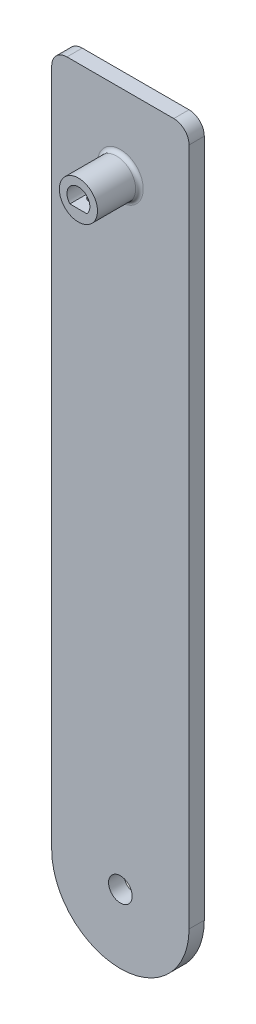
ISO-10303-21;
HEADER;
FILE_DESCRIPTION(('STEP AP214'),'2;1');
FILE_NAME('part.step','',(''),(''),'','','');
FILE_SCHEMA(('AUTOMOTIVE_DESIGN { 1 0 10303 214 1 1 1 1 }'));
ENDSEC;
DATA;
#1=APPLICATION_CONTEXT('core data for automotive mechanical design processes');
#2=APPLICATION_PROTOCOL_DEFINITION('international standard','automotive_design',2000,#1);
#3=PRODUCT_CONTEXT('',#1,'mechanical');
#4=PRODUCT('Part','Part','',(#3));
#5=PRODUCT_RELATED_PRODUCT_CATEGORY('part','',(#4));
#6=PRODUCT_DEFINITION_FORMATION('','',#4);
#7=PRODUCT_DEFINITION_CONTEXT('part definition',#1,'design');
#8=PRODUCT_DEFINITION('design','',#6,#7);
#9=PRODUCT_DEFINITION_SHAPE('','',#8);
#10=(LENGTH_UNIT() NAMED_UNIT(*) SI_UNIT(.MILLI.,.METRE.));
#11=(NAMED_UNIT(*) PLANE_ANGLE_UNIT() SI_UNIT($,.RADIAN.));
#12=(NAMED_UNIT(*) SI_UNIT($,.STERADIAN.) SOLID_ANGLE_UNIT());
#13=UNCERTAINTY_MEASURE_WITH_UNIT(LENGTH_MEASURE(1.E-05),#10,'distance_accuracy_value','');
#14=(GEOMETRIC_REPRESENTATION_CONTEXT(3) GLOBAL_UNCERTAINTY_ASSIGNED_CONTEXT((#13)) GLOBAL_UNIT_ASSIGNED_CONTEXT((#10,
#11,#12)) REPRESENTATION_CONTEXT('',''));
#15=CARTESIAN_POINT('',(0.,0.,0.));
#16=DIRECTION('',(0.,0.,1.));
#17=DIRECTION('',(1.,0.,0.));
#18=AXIS2_PLACEMENT_3D('',#15,#16,#17);
#19=CARTESIAN_POINT('',(0.,40.,6.5));
#20=DIRECTION('',(0.,0.,-1.));
#21=DIRECTION('',(-1.,0.,0.));
#22=AXIS2_PLACEMENT_3D('',#19,#20,#21);
#23=CYLINDRICAL_SURFACE('',#22,2.5);
#24=CARTESIAN_POINT('',(0.,40.,1.5));
#25=DIRECTION('',(0.,0.,1.));
#26=DIRECTION('',(1.,0.,0.));
#27=AXIS2_PLACEMENT_3D('',#24,#25,#26);
#28=CIRCLE('',#27,2.5);
#29=CARTESIAN_POINT('',(2.5,40.,1.5));
#30=VERTEX_POINT('',#29);
#31=EDGE_CURVE('E155',#30,#30,#28,.T.);
#32=ORIENTED_EDGE('',*,*,#31,.T.);
#33=EDGE_LOOP('',(#32));
#34=FACE_BOUND('',#33,.T.);
#35=CARTESIAN_POINT('',(0.,40.,6.5));
#36=DIRECTION('',(0.,0.,1.));
#37=DIRECTION('',(1.,0.,0.));
#38=AXIS2_PLACEMENT_3D('',#35,#36,#37);
#39=CIRCLE('',#38,2.5);
#40=CARTESIAN_POINT('',(2.5,40.,6.5));
#41=VERTEX_POINT('',#40);
#42=EDGE_CURVE('E124',#41,#41,#39,.T.);
#43=ORIENTED_EDGE('',*,*,#42,.F.);
#44=EDGE_LOOP('',(#43));
#45=FACE_BOUND('',#44,.T.);
#46=CARTESIAN_POINT('',(0.,37.5,3.));
#47=CARTESIAN_POINT('',(-0.0537465027214457,37.5000036438646,3.00000492591186));
#48=CARTESIAN_POINT('',(-0.107586282045337,37.5017535284653,3.00435887604419));
#49=CARTESIAN_POINT('',(-0.213748240208948,37.5085827344968,3.02162385176062));
#50=CARTESIAN_POINT('',(-0.266065888780624,37.5136711065056,3.03455813954307));
#51=CARTESIAN_POINT('',(-0.367476961363701,37.5266289539344,3.06843803902942));
#52=CARTESIAN_POINT('',(-0.416580330808479,37.5344893181796,3.08935742310837));
#53=CARTESIAN_POINT('',(-0.510535985164183,37.5522169460196,3.13850958666327));
#54=CARTESIAN_POINT('',(-0.555389738375495,37.5620835127097,3.16673982745946));
#55=CARTESIAN_POINT('',(-0.641750503785196,37.5833455691479,3.23111774928047));
#56=CARTESIAN_POINT('',(-0.683031136275107,37.594788515354,3.26755332812013));
#57=CARTESIAN_POINT('',(-0.759087502392361,37.617697115469,3.34670000173839));
#58=CARTESIAN_POINT('',(-0.793860053566766,37.629162777731,3.38941414860587));
#59=CARTESIAN_POINT('',(-0.857437283646439,37.6513860410143,3.48221403512113));
#60=CARTESIAN_POINT('',(-0.885907490597737,37.6620894201752,3.5325432430116));
#61=CARTESIAN_POINT('',(-0.933877359518574,37.680831764066,3.63776819921002));
#62=CARTESIAN_POINT('',(-0.953381282142917,37.6888719937791,3.69266176392418));
#63=CARTESIAN_POINT('',(-0.981949411697933,37.7008682116959,3.80285616679605));
#64=CARTESIAN_POINT('',(-0.991446982902823,37.704992898222,3.85802561778811));
#65=CARTESIAN_POINT('',(-1.00108648082001,37.7091799797543,3.96931749915363));
#66=CARTESIAN_POINT('',(-1.00123300815661,37.7092443723862,4.02543944731251));
#67=CARTESIAN_POINT('',(-0.992494683752272,37.7054474986,4.13287833572902));
#68=CARTESIAN_POINT('',(-0.984237657152568,37.7018591248078,4.18425785720451));
#69=CARTESIAN_POINT('',(-0.95997344014891,37.6916190619608,4.28482977800336));
#70=CARTESIAN_POINT('',(-0.943964897402316,37.6849668383916,4.33402179405515));
#71=CARTESIAN_POINT('',(-0.904347366275537,37.6692025745573,4.43000891809802));
#72=CARTESIAN_POINT('',(-0.880589931157659,37.6600431035961,4.47673461952734));
#73=CARTESIAN_POINT('',(-0.826253230366107,37.6403094180506,4.56570790818078));
#74=CARTESIAN_POINT('',(-0.795671402550422,37.6297346727158,4.6079538047014));
#75=CARTESIAN_POINT('',(-0.725775299727217,37.6073663162886,4.690204864401));
#76=CARTESIAN_POINT('',(-0.685968731485318,37.5955416751192,4.72978436472301));
#77=CARTESIAN_POINT('',(-0.600157213715097,37.5727008752086,4.80184223900102));
#78=CARTESIAN_POINT('',(-0.554151032667217,37.5616848777734,4.83431919870515));
#79=CARTESIAN_POINT('',(-0.456038826302921,37.5414265936773,4.89180872370792));
#80=CARTESIAN_POINT('',(-0.403830245673238,37.5322236495229,4.91666114059853));
#81=CARTESIAN_POINT('',(-0.295511882741441,37.5169258583562,4.95708393053903));
#82=CARTESIAN_POINT('',(-0.239404098424837,37.5108294326881,4.9726590187787));
#83=CARTESIAN_POINT('',(-0.12844794380391,37.5027193024655,4.99322414770985));
#84=CARTESIAN_POINT('',(-0.0737216469927678,37.5004852708324,4.99878622712678));
#85=CARTESIAN_POINT('',(0.0359226549039079,37.4996576074468,5.00085655026431));
#86=CARTESIAN_POINT('',(0.0908406066119613,37.5010630320885,4.99736714077375));
#87=CARTESIAN_POINT('',(0.196716369560993,37.5072121646812,4.981854123724));
#88=CARTESIAN_POINT('',(0.247741245887736,37.5118030432724,4.97022100982451));
#89=CARTESIAN_POINT('',(0.347067714030389,37.5237027929725,4.93928214584509));
#90=CARTESIAN_POINT('',(0.395368955112422,37.5310120132173,4.91997541016566));
#91=CARTESIAN_POINT('',(0.489539392908351,37.5479170261459,4.87360753016003));
#92=CARTESIAN_POINT('',(0.535289011377703,37.557575920101,4.84632726397843));
#93=CARTESIAN_POINT('',(0.621721795623278,37.5781331762724,4.78502983804718));
#94=CARTESIAN_POINT('',(0.662402920380562,37.5890320344486,4.75100997853869));
#95=CARTESIAN_POINT('',(0.740361521514409,37.6117744118094,4.67456499352519));
#96=CARTESIAN_POINT('',(0.777236966903032,37.6236327928747,4.6317332292469));
#97=CARTESIAN_POINT('',(0.843375598706855,37.6462916354143,4.54027995849532));
#98=CARTESIAN_POINT('',(0.872637530668754,37.6570919223674,4.49165749983003));
#99=CARTESIAN_POINT('',(0.922903750965813,37.6764285004615,4.38926915270295));
#100=CARTESIAN_POINT('',(0.943825297267226,37.6849418455761,4.33545800039385));
#101=CARTESIAN_POINT('',(0.976148109852652,37.6983816326103,4.22463317414242));
#102=CARTESIAN_POINT('',(0.987556402634657,37.70331072152,4.16762189709379));
#103=CARTESIAN_POINT('',(0.999857808639201,37.7086412035004,4.05643604911273));
#104=CARTESIAN_POINT('',(1.00144854115143,37.7093428949591,4.00235258020333));
#105=CARTESIAN_POINT('',(0.995901579638762,37.7069258198345,3.89472757114335));
#106=CARTESIAN_POINT('',(0.988764993956891,37.703807538376,3.84118596304871));
#107=CARTESIAN_POINT('',(0.966535683076824,37.6943667546049,3.73833390507248));
#108=CARTESIAN_POINT('',(0.951768746785489,37.6881758408628,3.6889398627835));
#109=CARTESIAN_POINT('',(0.915002724245507,37.6733799938365,3.59331068519326));
#110=CARTESIAN_POINT('',(0.893001640696907,37.66477439397,3.54707642655009));
#111=CARTESIAN_POINT('',(0.840936381379866,37.6455069519775,3.45619519036461));
#112=CARTESIAN_POINT('',(0.810482667579746,37.6347555884338,3.41179066493476));
#113=CARTESIAN_POINT('',(0.742946059635749,37.6126809781388,3.32850334139812));
#114=CARTESIAN_POINT('',(0.705861167409062,37.601357559758,3.28962221393584));
#115=CARTESIAN_POINT('',(0.623252753136232,37.578532164563,3.21589857336819));
#116=CARTESIAN_POINT('',(0.57733800057307,37.5670662101891,3.18148134655097));
#117=CARTESIAN_POINT('',(0.47995016014289,37.5459979664314,3.12083147868918));
#118=CARTESIAN_POINT('',(0.42847450227362,37.5363965445355,3.09460264392374));
#119=CARTESIAN_POINT('',(0.322369031247603,37.5203014259207,3.05168889240486));
#120=CARTESIAN_POINT('',(0.267815809109849,37.5137531847249,3.03483533821983));
#121=CARTESIAN_POINT('',(0.156438273140612,37.5042784689532,3.01068043952287));
#122=CARTESIAN_POINT('',(0.0996217629294583,37.5013405025218,3.00334878162805));
#123=CARTESIAN_POINT('',(0.0284561489454663,37.5001205024793,3.00030230951086));
#124=CARTESIAN_POINT('',(0.0142313443703799,37.4999990351541,2.9999986956854));
#125=CARTESIAN_POINT('',(0.,37.5,3.));
#126=B_SPLINE_CURVE_WITH_KNOTS('',3,(#46,#47,#48,#49,#50,#51,#52,#53,#54,#55,#56,#57,#58,#59,
#60,#61,#62,#63,#64,#65,#66,#67,#68,#69,#70,#71,#72,#73,#74,#75,#76,#77,#78,#79,#80,#81,#82,#83,
#84,#85,#86,#87,#88,#89,#90,#91,#92,#93,#94,#95,#96,#97,#98,#99,#100,#101,#102,#103,#104,#105,
#106,#107,#108,#109,#110,#111,#112,#113,#114,#115,#116,#117,#118,#119,#120,#121,#122,#123,#124,
#125),.UNSPECIFIED.,.T.,.F.,(4,2,2,2,2,2,2,2,2,2,2,2,2,2,2,2,2,2,2,2,2,2,2,2,2,2,2,2,2,2,2,2,2,
2,2,2,2,2,2,4),(0.,0.161201493946535,0.322841818003967,0.483955728735789,0.645013767839921,
0.812986908501986,0.981041974672058,1.15657629409609,1.33202711559134,1.49952052654414,
1.66693153170244,1.82269164200686,1.97847893628024,2.13744563149408,2.29647210969092,
2.46779174593278,2.63914546419866,2.81388456581403,2.98853478056895,3.15284592264004,
3.31711446785041,3.47400227782183,3.63091024496898,3.79261756699131,3.95438979749485,
4.12684237312207,4.29932334521874,4.47347522570414,4.64749836322967,4.80899836696374,
4.97047786281523,5.12557159274384,5.28070817902581,5.44472734028346,5.60879600674197,
5.78350211766918,5.95828931820266,6.12982150506659,6.30080626202171,6.34349022948398),.UNSPECIFIED.);
#127=CARTESIAN_POINT('',(0.,37.5,3.));
#128=VERTEX_POINT('',#127);
#129=EDGE_CURVE('E130',#128,#128,#126,.T.);
#130=ORIENTED_EDGE('',*,*,#129,.T.);
#131=EDGE_LOOP('',(#130));
#132=FACE_BOUND('',#131,.T.);
#133=ADVANCED_FACE('F36',(#34,#45,#132),#23,.T.);
#134=CARTESIAN_POINT('',(0.,0.,1.));
#135=DIRECTION('',(0.,0.,1.));
#136=DIRECTION('',(1.,0.,0.));
#137=AXIS2_PLACEMENT_3D('',#134,#135,#136);
#138=PLANE('',#137);
#139=CARTESIAN_POINT('',(0.,-41.,1.));
#140=DIRECTION('',(0.,0.,1.));
#141=DIRECTION('',(1.,0.,0.));
#142=AXIS2_PLACEMENT_3D('',#139,#140,#141);
#143=CIRCLE('',#142,1.55);
#144=CARTESIAN_POINT('',(1.55,-41.,1.));
#145=VERTEX_POINT('',#144);
#146=EDGE_CURVE('E184',#145,#145,#143,.T.);
#147=ORIENTED_EDGE('',*,*,#146,.F.);
#148=EDGE_LOOP('',(#147));
#149=FACE_BOUND('',#148,.T.);
#150=CARTESIAN_POINT('',(0.,40.,1.));
#151=DIRECTION('',(0.,0.,1.));
#152=DIRECTION('',(1.,0.,0.));
#153=AXIS2_PLACEMENT_3D('',#150,#151,#152);
#154=CIRCLE('',#153,3.);
#155=CARTESIAN_POINT('',(3.,40.,1.));
#156=VERTEX_POINT('',#155);
#157=EDGE_CURVE('E158',#156,#156,#154,.F.);
#158=ORIENTED_EDGE('',*,*,#157,.T.);
#159=EDGE_LOOP('',(#158));
#160=FACE_BOUND('',#159,.T.);
#161=DIRECTION('',(0.,-1.,0.));
#162=VECTOR('',#161,1.);
#163=CARTESIAN_POINT('',(-9.,-50.,1.));
#164=LINE('',#163,#162);
#165=CARTESIAN_POINT('',(-9.,48.,1.));
#166=VERTEX_POINT('',#165);
#167=CARTESIAN_POINT('',(-9.,-41.,1.));
#168=VERTEX_POINT('',#167);
#169=EDGE_CURVE('E141',#166,#168,#164,.T.);
#170=ORIENTED_EDGE('',*,*,#169,.T.);
#171=CARTESIAN_POINT('',(0.,-41.,1.));
#172=DIRECTION('',(0.,0.,1.));
#173=DIRECTION('',(1.,0.,0.));
#174=AXIS2_PLACEMENT_3D('',#171,#172,#173);
#175=CIRCLE('',#174,9.);
#176=CARTESIAN_POINT('',(0.,-50.,1.));
#177=VERTEX_POINT('',#176);
#178=EDGE_CURVE('E189',#168,#177,#175,.T.);
#179=ORIENTED_EDGE('',*,*,#178,.T.);
#180=CARTESIAN_POINT('',(0.,-41.,1.));
#181=DIRECTION('',(0.,0.,1.));
#182=DIRECTION('',(1.,0.,0.));
#183=AXIS2_PLACEMENT_3D('',#180,#181,#182);
#184=CIRCLE('',#183,9.);
#185=CARTESIAN_POINT('',(9.,-41.,1.));
#186=VERTEX_POINT('',#185);
#187=EDGE_CURVE('E187',#177,#186,#184,.T.);
#188=ORIENTED_EDGE('',*,*,#187,.T.);
#189=DIRECTION('',(0.,1.,0.));
#190=VECTOR('',#189,1.);
#191=CARTESIAN_POINT('',(9.,-50.,1.));
#192=LINE('',#191,#190);
#193=CARTESIAN_POINT('',(9.,48.,1.));
#194=VERTEX_POINT('',#193);
#195=EDGE_CURVE('E136',#186,#194,#192,.T.);
#196=ORIENTED_EDGE('',*,*,#195,.T.);
#197=CARTESIAN_POINT('',(7.,48.,1.));
#198=DIRECTION('',(0.,0.,1.));
#199=DIRECTION('',(1.,0.,0.));
#200=AXIS2_PLACEMENT_3D('',#197,#198,#199);
#201=CIRCLE('',#200,2.);
#202=CARTESIAN_POINT('',(7.,50.,1.));
#203=VERTEX_POINT('',#202);
#204=EDGE_CURVE('E166',#194,#203,#201,.T.);
#205=ORIENTED_EDGE('',*,*,#204,.T.);
#206=DIRECTION('',(-1.,0.,0.));
#207=VECTOR('',#206,1.);
#208=CARTESIAN_POINT('',(9.,50.,1.));
#209=LINE('',#208,#207);
#210=CARTESIAN_POINT('',(-7.,50.,1.));
#211=VERTEX_POINT('',#210);
#212=EDGE_CURVE('E138',#203,#211,#209,.T.);
#213=ORIENTED_EDGE('',*,*,#212,.T.);
#214=CARTESIAN_POINT('',(-7.,48.,1.));
#215=DIRECTION('',(0.,0.,1.));
#216=DIRECTION('',(1.,0.,0.));
#217=AXIS2_PLACEMENT_3D('',#214,#215,#216);
#218=CIRCLE('',#217,2.);
#219=EDGE_CURVE('E168',#211,#166,#218,.T.);
#220=ORIENTED_EDGE('',*,*,#219,.T.);
#221=EDGE_LOOP('',(#170,#179,#188,#196,#205,#213,#220));
#222=FACE_BOUND('',#221,.T.);
#223=ADVANCED_FACE('F206',(#149,#160,#222),#138,.T.);
#224=CARTESIAN_POINT('',(9.,-50.,-1.));
#225=DIRECTION('',(1.,0.,0.));
#226=DIRECTION('',(0.,0.,-1.));
#227=AXIS2_PLACEMENT_3D('',#224,#225,#226);
#228=PLANE('',#227);
#229=ORIENTED_EDGE('',*,*,#195,.F.);
#230=DIRECTION('',(0.,0.,1.));
#231=VECTOR('',#230,1.);
#232=CARTESIAN_POINT('',(9.,-41.,-1.));
#233=LINE('',#232,#231);
#234=CARTESIAN_POINT('',(9.,-41.,-1.));
#235=VERTEX_POINT('',#234);
#236=EDGE_CURVE('E11',#186,#235,#233,.F.);
#237=ORIENTED_EDGE('',*,*,#236,.T.);
#238=DIRECTION('',(0.,1.,0.));
#239=VECTOR('',#238,1.);
#240=CARTESIAN_POINT('',(9.,-50.,-1.));
#241=LINE('',#240,#239);
#242=CARTESIAN_POINT('',(9.,48.,-1.));
#243=VERTEX_POINT('',#242);
#244=EDGE_CURVE('E118',#235,#243,#241,.T.);
#245=ORIENTED_EDGE('',*,*,#244,.T.);
#246=DIRECTION('',(0.,0.,1.));
#247=VECTOR('',#246,1.);
#248=CARTESIAN_POINT('',(9.,48.,-1.));
#249=LINE('',#248,#247);
#250=EDGE_CURVE('E177',#243,#194,#249,.T.);
#251=ORIENTED_EDGE('',*,*,#250,.T.);
#252=EDGE_LOOP('',(#229,#237,#245,#251));
#253=FACE_BOUND('',#252,.T.);
#254=ADVANCED_FACE('F223',(#253),#228,.T.);
#255=CARTESIAN_POINT('',(-9.,-50.,-1.));
#256=DIRECTION('',(-1.,0.,0.));
#257=DIRECTION('',(0.,0.,1.));
#258=AXIS2_PLACEMENT_3D('',#255,#256,#257);
#259=PLANE('',#258);
#260=DIRECTION('',(0.,-1.,0.));
#261=VECTOR('',#260,1.);
#262=CARTESIAN_POINT('',(-9.,-50.,-1.));
#263=LINE('',#262,#261);
#264=CARTESIAN_POINT('',(-9.,48.,-1.));
#265=VERTEX_POINT('',#264);
#266=CARTESIAN_POINT('',(-9.,-41.,-1.));
#267=VERTEX_POINT('',#266);
#268=EDGE_CURVE('E152',#265,#267,#263,.T.);
#269=ORIENTED_EDGE('',*,*,#268,.T.);
#270=DIRECTION('',(0.,0.,1.));
#271=VECTOR('',#270,1.);
#272=CARTESIAN_POINT('',(-9.,-41.,-1.));
#273=LINE('',#272,#271);
#274=EDGE_CURVE('E180',#267,#168,#273,.T.);
#275=ORIENTED_EDGE('',*,*,#274,.T.);
#276=ORIENTED_EDGE('',*,*,#169,.F.);
#277=DIRECTION('',(0.,0.,1.));
#278=VECTOR('',#277,1.);
#279=CARTESIAN_POINT('',(-9.,48.,-1.));
#280=LINE('',#279,#278);
#281=EDGE_CURVE('E170',#166,#265,#280,.F.);
#282=ORIENTED_EDGE('',*,*,#281,.T.);
#283=EDGE_LOOP('',(#269,#275,#276,#282));
#284=FACE_BOUND('',#283,.T.);
#285=ADVANCED_FACE('F200',(#284),#259,.T.);
#286=CARTESIAN_POINT('',(9.,50.,-1.));
#287=DIRECTION('',(0.,1.,0.));
#288=DIRECTION('',(0.,0.,1.));
#289=AXIS2_PLACEMENT_3D('',#286,#287,#288);
#290=PLANE('',#289);
#291=DIRECTION('',(-1.,0.,0.));
#292=VECTOR('',#291,1.);
#293=CARTESIAN_POINT('',(9.,50.,-1.));
#294=LINE('',#293,#292);
#295=CARTESIAN_POINT('',(7.,50.,-1.));
#296=VERTEX_POINT('',#295);
#297=CARTESIAN_POINT('',(-7.,50.,-1.));
#298=VERTEX_POINT('',#297);
#299=EDGE_CURVE('E149',#296,#298,#294,.T.);
#300=ORIENTED_EDGE('',*,*,#299,.T.);
#301=DIRECTION('',(0.,0.,1.));
#302=VECTOR('',#301,1.);
#303=CARTESIAN_POINT('',(-7.,50.,-1.));
#304=LINE('',#303,#302);
#305=EDGE_CURVE('E163',#298,#211,#304,.T.);
#306=ORIENTED_EDGE('',*,*,#305,.T.);
#307=ORIENTED_EDGE('',*,*,#212,.F.);
#308=DIRECTION('',(0.,0.,1.));
#309=VECTOR('',#308,1.);
#310=CARTESIAN_POINT('',(7.,50.,-1.));
#311=LINE('',#310,#309);
#312=EDGE_CURVE('E161',#203,#296,#311,.F.);
#313=ORIENTED_EDGE('',*,*,#312,.T.);
#314=EDGE_LOOP('',(#300,#306,#307,#313));
#315=FACE_BOUND('',#314,.T.);
#316=ADVANCED_FACE('F237',(#315),#290,.T.);
#317=CARTESIAN_POINT('',(0.,0.,-1.));
#318=DIRECTION('',(0.,0.,1.));
#319=DIRECTION('',(1.,0.,0.));
#320=AXIS2_PLACEMENT_3D('',#317,#318,#319);
#321=PLANE('',#320);
#322=CARTESIAN_POINT('',(0.,-41.,-1.));
#323=DIRECTION('',(0.,0.,1.));
#324=DIRECTION('',(1.,0.,0.));
#325=AXIS2_PLACEMENT_3D('',#322,#323,#324);
#326=CIRCLE('',#325,1.55);
#327=CARTESIAN_POINT('',(1.55,-41.,-1.));
#328=VERTEX_POINT('',#327);
#329=EDGE_CURVE('E181',#328,#328,#326,.T.);
#330=ORIENTED_EDGE('',*,*,#329,.T.);
#331=EDGE_LOOP('',(#330));
#332=FACE_BOUND('',#331,.T.);
#333=DIRECTION('',(1.,0.,0.));
#334=VECTOR('',#333,1.);
#335=CARTESIAN_POINT('',(1.11803398874989,39.,-1.));
#336=LINE('',#335,#334);
#337=CARTESIAN_POINT('',(-1.11803398874989,39.,-1.));
#338=VERTEX_POINT('',#337);
#339=CARTESIAN_POINT('',(1.11803398874989,39.,-1.));
#340=VERTEX_POINT('',#339);
#341=EDGE_CURVE('E145',#338,#340,#336,.T.);
#342=ORIENTED_EDGE('',*,*,#341,.T.);
#343=CARTESIAN_POINT('',(0.,40.,-1.));
#344=DIRECTION('',(0.,0.,1.));
#345=DIRECTION('',(1.,0.,0.));
#346=AXIS2_PLACEMENT_3D('',#343,#344,#345);
#347=CIRCLE('',#346,1.5);
#348=EDGE_CURVE('E114',#340,#338,#347,.T.);
#349=ORIENTED_EDGE('',*,*,#348,.T.);
#350=EDGE_LOOP('',(#342,#349));
#351=FACE_BOUND('',#350,.T.);
#352=CARTESIAN_POINT('',(0.,-41.,-1.));
#353=DIRECTION('',(0.,0.,1.));
#354=DIRECTION('',(1.,0.,0.));
#355=AXIS2_PLACEMENT_3D('',#352,#353,#354);
#356=CIRCLE('',#355,9.);
#357=CARTESIAN_POINT('',(0.,-50.,-1.));
#358=VERTEX_POINT('',#357);
#359=EDGE_CURVE('E52',#235,#358,#356,.F.);
#360=ORIENTED_EDGE('',*,*,#359,.T.);
#361=CARTESIAN_POINT('',(0.,-41.,-1.));
#362=DIRECTION('',(0.,0.,1.));
#363=DIRECTION('',(1.,0.,0.));
#364=AXIS2_PLACEMENT_3D('',#361,#362,#363);
#365=CIRCLE('',#364,9.);
#366=EDGE_CURVE('E45',#358,#267,#365,.F.);
#367=ORIENTED_EDGE('',*,*,#366,.T.);
#368=ORIENTED_EDGE('',*,*,#268,.F.);
#369=CARTESIAN_POINT('',(-7.,48.,-1.));
#370=DIRECTION('',(0.,0.,1.));
#371=DIRECTION('',(1.,0.,0.));
#372=AXIS2_PLACEMENT_3D('',#369,#370,#371);
#373=CIRCLE('',#372,2.);
#374=EDGE_CURVE('E175',#265,#298,#373,.F.);
#375=ORIENTED_EDGE('',*,*,#374,.T.);
#376=ORIENTED_EDGE('',*,*,#299,.F.);
#377=CARTESIAN_POINT('',(7.,48.,-1.));
#378=DIRECTION('',(0.,0.,1.));
#379=DIRECTION('',(1.,0.,0.));
#380=AXIS2_PLACEMENT_3D('',#377,#378,#379);
#381=CIRCLE('',#380,2.);
#382=EDGE_CURVE('E172',#296,#243,#381,.F.);
#383=ORIENTED_EDGE('',*,*,#382,.T.);
#384=ORIENTED_EDGE('',*,*,#244,.F.);
#385=EDGE_LOOP('',(#360,#367,#368,#375,#376,#383,#384));
#386=FACE_BOUND('',#385,.T.);
#387=ADVANCED_FACE('F194',(#332,#351,#386),#321,.F.);
#388=CARTESIAN_POINT('',(0.,40.,-1.));
#389=DIRECTION('',(0.,0.,1.));
#390=DIRECTION('',(1.,0.,0.));
#391=AXIS2_PLACEMENT_3D('',#388,#389,#390);
#392=CYLINDRICAL_SURFACE('',#391,1.5);
#393=DIRECTION('',(0.,0.,1.));
#394=VECTOR('',#393,1.);
#395=CARTESIAN_POINT('',(1.11803398874989,39.,-1.));
#396=LINE('',#395,#394);
#397=CARTESIAN_POINT('',(1.11803398874989,39.,6.5));
#398=VERTEX_POINT('',#397);
#399=EDGE_CURVE('E107',#340,#398,#396,.T.);
#400=ORIENTED_EDGE('',*,*,#399,.T.);
#401=CARTESIAN_POINT('',(0.,40.,6.5));
#402=DIRECTION('',(0.,0.,1.));
#403=DIRECTION('',(1.,0.,0.));
#404=AXIS2_PLACEMENT_3D('',#401,#402,#403);
#405=CIRCLE('',#404,1.5);
#406=CARTESIAN_POINT('',(-1.11803398874989,39.,6.5));
#407=VERTEX_POINT('',#406);
#408=EDGE_CURVE('E111',#398,#407,#405,.T.);
#409=ORIENTED_EDGE('',*,*,#408,.T.);
#410=DIRECTION('',(0.,0.,1.));
#411=VECTOR('',#410,1.);
#412=CARTESIAN_POINT('',(-1.11803398874989,39.,-1.));
#413=LINE('',#412,#411);
#414=EDGE_CURVE('E119',#338,#407,#413,.T.);
#415=ORIENTED_EDGE('',*,*,#414,.F.);
#416=ORIENTED_EDGE('',*,*,#348,.F.);
#417=EDGE_LOOP('',(#400,#409,#415,#416));
#418=FACE_BOUND('',#417,.T.);
#419=ADVANCED_FACE('F109',(#418),#392,.F.);
#420=CARTESIAN_POINT('',(1.11803398874989,39.,-1.));
#421=DIRECTION('',(0.,-1.,0.));
#422=DIRECTION('',(0.,0.,-1.));
#423=AXIS2_PLACEMENT_3D('',#420,#421,#422);
#424=PLANE('',#423);
#425=CARTESIAN_POINT('',(0.,39.,4.));
#426=DIRECTION('',(0.,-1.,0.));
#427=DIRECTION('',(0.,0.,-1.));
#428=AXIS2_PLACEMENT_3D('',#425,#426,#427);
#429=CIRCLE('',#428,1.);
#430=CARTESIAN_POINT('',(0.,39.,3.));
#431=VERTEX_POINT('',#430);
#432=EDGE_CURVE('E127',#431,#431,#429,.T.);
#433=ORIENTED_EDGE('',*,*,#432,.T.);
#434=EDGE_LOOP('',(#433));
#435=FACE_BOUND('',#434,.T.);
#436=ORIENTED_EDGE('',*,*,#414,.T.);
#437=DIRECTION('',(1.,0.,0.));
#438=VECTOR('',#437,1.);
#439=CARTESIAN_POINT('',(-1.11803398874989,39.,6.5));
#440=LINE('',#439,#438);
#441=EDGE_CURVE('E121',#407,#398,#440,.T.);
#442=ORIENTED_EDGE('',*,*,#441,.T.);
#443=ORIENTED_EDGE('',*,*,#399,.F.);
#444=ORIENTED_EDGE('',*,*,#341,.F.);
#445=EDGE_LOOP('',(#436,#442,#443,#444));
#446=FACE_BOUND('',#445,.T.);
#447=ADVANCED_FACE('F122',(#435,#446),#424,.F.);
#448=CARTESIAN_POINT('',(0.,40.,6.5));
#449=DIRECTION('',(0.,0.,1.));
#450=DIRECTION('',(1.,0.,0.));
#451=AXIS2_PLACEMENT_3D('',#448,#449,#450);
#452=PLANE('',#451);
#453=ORIENTED_EDGE('',*,*,#42,.T.);
#454=EDGE_LOOP('',(#453));
#455=FACE_BOUND('',#454,.T.);
#456=ORIENTED_EDGE('',*,*,#441,.F.);
#457=ORIENTED_EDGE('',*,*,#408,.F.);
#458=EDGE_LOOP('',(#456,#457));
#459=FACE_BOUND('',#458,.T.);
#460=ADVANCED_FACE('F126',(#455,#459),#452,.T.);
#461=CARTESIAN_POINT('',(0.,40.,1.5));
#462=DIRECTION('',(0.,0.,1.));
#463=DIRECTION('',(1.,0.,0.));
#464=AXIS2_PLACEMENT_3D('',#461,#462,#463);
#465=TOROIDAL_SURFACE('',#464,3.,0.5);
#466=ORIENTED_EDGE('',*,*,#157,.F.);
#467=EDGE_LOOP('',(#466));
#468=FACE_BOUND('',#467,.T.);
#469=ORIENTED_EDGE('',*,*,#31,.F.);
#470=EDGE_LOOP('',(#469));
#471=FACE_BOUND('',#470,.T.);
#472=ADVANCED_FACE('F246',(#468,#471),#465,.F.);
#473=CARTESIAN_POINT('',(-7.,48.,-1.));
#474=DIRECTION('',(0.,0.,1.));
#475=DIRECTION('',(1.,0.,0.));
#476=AXIS2_PLACEMENT_3D('',#473,#474,#475);
#477=CYLINDRICAL_SURFACE('',#476,2.);
#478=ORIENTED_EDGE('',*,*,#374,.F.);
#479=ORIENTED_EDGE('',*,*,#281,.F.);
#480=ORIENTED_EDGE('',*,*,#219,.F.);
#481=ORIENTED_EDGE('',*,*,#305,.F.);
#482=EDGE_LOOP('',(#478,#479,#480,#481));
#483=FACE_BOUND('',#482,.T.);
#484=ADVANCED_FACE('F249',(#483),#477,.T.);
#485=CARTESIAN_POINT('',(7.,48.,-1.));
#486=DIRECTION('',(0.,0.,1.));
#487=DIRECTION('',(1.,0.,0.));
#488=AXIS2_PLACEMENT_3D('',#485,#486,#487);
#489=CYLINDRICAL_SURFACE('',#488,2.);
#490=ORIENTED_EDGE('',*,*,#382,.F.);
#491=ORIENTED_EDGE('',*,*,#312,.F.);
#492=ORIENTED_EDGE('',*,*,#204,.F.);
#493=ORIENTED_EDGE('',*,*,#250,.F.);
#494=EDGE_LOOP('',(#490,#491,#492,#493));
#495=FACE_BOUND('',#494,.T.);
#496=ADVANCED_FACE('F253',(#495),#489,.T.);
#497=CARTESIAN_POINT('',(0.,50.001,4.));
#498=DIRECTION('',(0.,-1.,0.));
#499=DIRECTION('',(0.,0.,-1.));
#500=AXIS2_PLACEMENT_3D('',#497,#498,#499);
#501=CYLINDRICAL_SURFACE('',#500,1.);
#502=ORIENTED_EDGE('',*,*,#129,.F.);
#503=EDGE_LOOP('',(#502));
#504=FACE_BOUND('',#503,.T.);
#505=ORIENTED_EDGE('',*,*,#432,.F.);
#506=EDGE_LOOP('',(#505));
#507=FACE_BOUND('',#506,.T.);
#508=ADVANCED_FACE('F214',(#504,#507),#501,.F.);
#509=CARTESIAN_POINT('',(0.,-41.,6.5));
#510=DIRECTION('',(0.,0.,-1.));
#511=DIRECTION('',(-1.,0.,0.));
#512=AXIS2_PLACEMENT_3D('',#509,#510,#511);
#513=CYLINDRICAL_SURFACE('',#512,1.55);
#514=ORIENTED_EDGE('',*,*,#146,.T.);
#515=EDGE_LOOP('',(#514));
#516=FACE_BOUND('',#515,.T.);
#517=ORIENTED_EDGE('',*,*,#329,.F.);
#518=EDGE_LOOP('',(#517));
#519=FACE_BOUND('',#518,.T.);
#520=ADVANCED_FACE('F209',(#516,#519),#513,.F.);
#521=CARTESIAN_POINT('',(0.,-41.,-1.));
#522=DIRECTION('',(0.,0.,1.));
#523=DIRECTION('',(1.,0.,0.));
#524=AXIS2_PLACEMENT_3D('',#521,#522,#523);
#525=CYLINDRICAL_SURFACE('',#524,9.);
#526=DIRECTION('',(0.,0.,1.));
#527=VECTOR('',#526,1.);
#528=CARTESIAN_POINT('',(0.,-50.,-1.));
#529=LINE('',#528,#527);
#530=EDGE_CURVE('E40',#358,#177,#529,.T.);
#531=ORIENTED_EDGE('',*,*,#530,.F.);
#532=ORIENTED_EDGE('',*,*,#359,.F.);
#533=ORIENTED_EDGE('',*,*,#236,.F.);
#534=ORIENTED_EDGE('',*,*,#187,.F.);
#535=EDGE_LOOP('',(#531,#532,#533,#534));
#536=FACE_BOUND('',#535,.T.);
#537=ADVANCED_FACE('F38',(#536),#525,.T.);
#538=CARTESIAN_POINT('',(0.,-41.,-1.));
#539=DIRECTION('',(0.,0.,1.));
#540=DIRECTION('',(1.,0.,0.));
#541=AXIS2_PLACEMENT_3D('',#538,#539,#540);
#542=CYLINDRICAL_SURFACE('',#541,9.);
#543=ORIENTED_EDGE('',*,*,#366,.F.);
#544=ORIENTED_EDGE('',*,*,#530,.T.);
#545=ORIENTED_EDGE('',*,*,#178,.F.);
#546=ORIENTED_EDGE('',*,*,#274,.F.);
#547=EDGE_LOOP('',(#543,#544,#545,#546));
#548=FACE_BOUND('',#547,.T.);
#549=ADVANCED_FACE('F203',(#548),#542,.T.);
#550=CLOSED_SHELL('',(#133,#223,#254,#285,#316,#387,#419,#447,#460,#472,#484,#496,#508,#520,
#537,#549));
#551=MANIFOLD_SOLID_BREP('B2',#550);
#552=ADVANCED_BREP_SHAPE_REPRESENTATION('',(#18,#551),#14);
#553=SHAPE_DEFINITION_REPRESENTATION(#9,#552);
ENDSEC;
END-ISO-10303-21;
